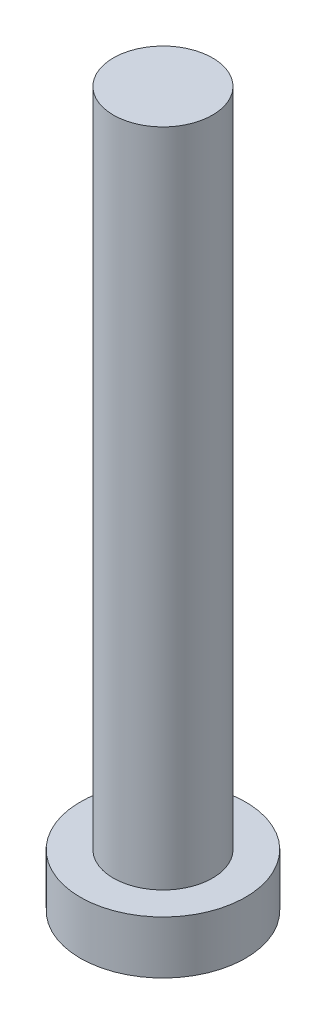
ISO-10303-21;
HEADER;
FILE_DESCRIPTION(('STEP AP214'),'2;1');
FILE_NAME('part.step','',(''),(''),'','','');
FILE_SCHEMA(('AUTOMOTIVE_DESIGN { 1 0 10303 214 1 1 1 1 }'));
ENDSEC;
DATA;
#1=APPLICATION_CONTEXT('core data for automotive mechanical design processes');
#2=APPLICATION_PROTOCOL_DEFINITION('international standard','automotive_design',2000,#1);
#3=PRODUCT_CONTEXT('',#1,'mechanical');
#4=PRODUCT('Part','Part','',(#3));
#5=PRODUCT_RELATED_PRODUCT_CATEGORY('part','',(#4));
#6=PRODUCT_DEFINITION_FORMATION('','',#4);
#7=PRODUCT_DEFINITION_CONTEXT('part definition',#1,'design');
#8=PRODUCT_DEFINITION('design','',#6,#7);
#9=PRODUCT_DEFINITION_SHAPE('','',#8);
#10=(LENGTH_UNIT() NAMED_UNIT(*) SI_UNIT(.MILLI.,.METRE.));
#11=(NAMED_UNIT(*) PLANE_ANGLE_UNIT() SI_UNIT($,.RADIAN.));
#12=(NAMED_UNIT(*) SI_UNIT($,.STERADIAN.) SOLID_ANGLE_UNIT());
#13=UNCERTAINTY_MEASURE_WITH_UNIT(LENGTH_MEASURE(1.E-05),#10,'distance_accuracy_value','');
#14=(GEOMETRIC_REPRESENTATION_CONTEXT(3) GLOBAL_UNCERTAINTY_ASSIGNED_CONTEXT((#13)) GLOBAL_UNIT_ASSIGNED_CONTEXT((#10,
#11,#12)) REPRESENTATION_CONTEXT('',''));
#15=CARTESIAN_POINT('',(0.,0.,0.));
#16=DIRECTION('',(0.,0.,1.));
#17=DIRECTION('',(1.,0.,0.));
#18=AXIS2_PLACEMENT_3D('',#15,#16,#17);
#19=CARTESIAN_POINT('',(0.,0.,0.));
#20=DIRECTION('',(0.,1.,0.));
#21=DIRECTION('',(0.,0.,1.));
#22=AXIS2_PLACEMENT_3D('',#19,#20,#21);
#23=PLANE('',#22);
#24=CARTESIAN_POINT('',(0.,0.,0.));
#25=DIRECTION('',(0.,1.,0.));
#26=DIRECTION('',(0.,0.,1.));
#27=AXIS2_PLACEMENT_3D('',#24,#25,#26);
#28=CIRCLE('',#27,2.5);
#29=CARTESIAN_POINT('',(0.,0.,2.5));
#30=VERTEX_POINT('',#29);
#31=EDGE_CURVE('E39',#30,#30,#28,.T.);
#32=ORIENTED_EDGE('',*,*,#31,.F.);
#33=EDGE_LOOP('',(#32));
#34=FACE_BOUND('',#33,.T.);
#35=CARTESIAN_POINT('',(1.,0.,1.));
#36=DIRECTION('',(0.,1.,0.));
#37=DIRECTION('',(0.,0.,-1.));
#38=AXIS2_PLACEMENT_3D('',#35,#36,#37);
#39=CIRCLE('',#38,0.5);
#40=CARTESIAN_POINT('',(1.,0.,0.5));
#41=VERTEX_POINT('',#40);
#42=CARTESIAN_POINT('',(0.5,0.,1.));
#43=VERTEX_POINT('',#42);
#44=EDGE_CURVE('E186',#41,#43,#39,.T.);
#45=ORIENTED_EDGE('',*,*,#44,.F.);
#46=DIRECTION('',(-1.,0.,0.));
#47=VECTOR('',#46,1.);
#48=CARTESIAN_POINT('',(1.,0.,0.5));
#49=LINE('',#48,#47);
#50=CARTESIAN_POINT('',(1.75,0.,0.5));
#51=VERTEX_POINT('',#50);
#52=EDGE_CURVE('E52',#51,#41,#49,.T.);
#53=ORIENTED_EDGE('',*,*,#52,.F.);
#54=DIRECTION('',(0.,0.,1.));
#55=VECTOR('',#54,1.);
#56=CARTESIAN_POINT('',(1.75,0.,-0.5));
#57=LINE('',#56,#55);
#58=CARTESIAN_POINT('',(1.75,0.,-0.5));
#59=VERTEX_POINT('',#58);
#60=EDGE_CURVE('E225',#59,#51,#57,.T.);
#61=ORIENTED_EDGE('',*,*,#60,.F.);
#62=DIRECTION('',(1.,0.,0.));
#63=VECTOR('',#62,1.);
#64=CARTESIAN_POINT('',(1.,0.,-0.5));
#65=LINE('',#64,#63);
#66=CARTESIAN_POINT('',(1.,0.,-0.5));
#67=VERTEX_POINT('',#66);
#68=EDGE_CURVE('E223',#67,#59,#65,.T.);
#69=ORIENTED_EDGE('',*,*,#68,.F.);
#70=CARTESIAN_POINT('',(1.,0.,-1.));
#71=DIRECTION('',(0.,1.,0.));
#72=DIRECTION('',(0.,0.,-1.));
#73=AXIS2_PLACEMENT_3D('',#70,#71,#72);
#74=CIRCLE('',#73,0.5);
#75=CARTESIAN_POINT('',(0.5,0.,-1.));
#76=VERTEX_POINT('',#75);
#77=EDGE_CURVE('E160',#76,#67,#74,.T.);
#78=ORIENTED_EDGE('',*,*,#77,.F.);
#79=DIRECTION('',(0.,0.,1.));
#80=VECTOR('',#79,1.);
#81=CARTESIAN_POINT('',(0.5,0.,-1.75));
#82=LINE('',#81,#80);
#83=CARTESIAN_POINT('',(0.5,0.,-1.75));
#84=VERTEX_POINT('',#83);
#85=EDGE_CURVE('E219',#84,#76,#82,.T.);
#86=ORIENTED_EDGE('',*,*,#85,.F.);
#87=DIRECTION('',(1.,0.,0.));
#88=VECTOR('',#87,1.);
#89=CARTESIAN_POINT('',(-0.5,0.,-1.75));
#90=LINE('',#89,#88);
#91=CARTESIAN_POINT('',(-0.5,0.,-1.75));
#92=VERTEX_POINT('',#91);
#93=EDGE_CURVE('E216',#92,#84,#90,.T.);
#94=ORIENTED_EDGE('',*,*,#93,.F.);
#95=DIRECTION('',(0.,0.,-1.));
#96=VECTOR('',#95,1.);
#97=CARTESIAN_POINT('',(-0.5,0.,-1.75));
#98=LINE('',#97,#96);
#99=CARTESIAN_POINT('',(-0.5,0.,-1.));
#100=VERTEX_POINT('',#99);
#101=EDGE_CURVE('E213',#100,#92,#98,.T.);
#102=ORIENTED_EDGE('',*,*,#101,.F.);
#103=CARTESIAN_POINT('',(-1.,0.,-1.));
#104=DIRECTION('',(0.,1.,0.));
#105=DIRECTION('',(0.,0.,-1.));
#106=AXIS2_PLACEMENT_3D('',#103,#104,#105);
#107=CIRCLE('',#106,0.5);
#108=CARTESIAN_POINT('',(-1.,0.,-0.5));
#109=VERTEX_POINT('',#108);
#110=EDGE_CURVE('E210',#109,#100,#107,.T.);
#111=ORIENTED_EDGE('',*,*,#110,.F.);
#112=DIRECTION('',(1.,0.,0.));
#113=VECTOR('',#112,1.);
#114=CARTESIAN_POINT('',(-1.75,0.,-0.5));
#115=LINE('',#114,#113);
#116=CARTESIAN_POINT('',(-1.75,0.,-0.5));
#117=VERTEX_POINT('',#116);
#118=EDGE_CURVE('E207',#117,#109,#115,.T.);
#119=ORIENTED_EDGE('',*,*,#118,.F.);
#120=DIRECTION('',(0.,0.,-1.));
#121=VECTOR('',#120,1.);
#122=CARTESIAN_POINT('',(-1.75,0.,-0.5));
#123=LINE('',#122,#121);
#124=CARTESIAN_POINT('',(-1.75,0.,0.5));
#125=VERTEX_POINT('',#124);
#126=EDGE_CURVE('E204',#125,#117,#123,.T.);
#127=ORIENTED_EDGE('',*,*,#126,.F.);
#128=DIRECTION('',(-1.,0.,0.));
#129=VECTOR('',#128,1.);
#130=CARTESIAN_POINT('',(-1.75,0.,0.5));
#131=LINE('',#130,#129);
#132=CARTESIAN_POINT('',(-1.,0.,0.5));
#133=VERTEX_POINT('',#132);
#134=EDGE_CURVE('E201',#133,#125,#131,.T.);
#135=ORIENTED_EDGE('',*,*,#134,.F.);
#136=CARTESIAN_POINT('',(-1.,0.,1.));
#137=DIRECTION('',(0.,1.,0.));
#138=DIRECTION('',(0.,0.,1.));
#139=AXIS2_PLACEMENT_3D('',#136,#137,#138);
#140=CIRCLE('',#139,0.5);
#141=CARTESIAN_POINT('',(-0.5,0.,1.));
#142=VERTEX_POINT('',#141);
#143=EDGE_CURVE('E198',#142,#133,#140,.T.);
#144=ORIENTED_EDGE('',*,*,#143,.F.);
#145=DIRECTION('',(0.,0.,-1.));
#146=VECTOR('',#145,1.);
#147=CARTESIAN_POINT('',(-0.5,0.,1.));
#148=LINE('',#147,#146);
#149=CARTESIAN_POINT('',(-0.5,0.,1.75));
#150=VERTEX_POINT('',#149);
#151=EDGE_CURVE('E195',#150,#142,#148,.T.);
#152=ORIENTED_EDGE('',*,*,#151,.F.);
#153=DIRECTION('',(-1.,0.,0.));
#154=VECTOR('',#153,1.);
#155=CARTESIAN_POINT('',(-0.5,0.,1.75));
#156=LINE('',#155,#154);
#157=CARTESIAN_POINT('',(0.5,0.,1.75));
#158=VERTEX_POINT('',#157);
#159=EDGE_CURVE('E192',#158,#150,#156,.T.);
#160=ORIENTED_EDGE('',*,*,#159,.F.);
#161=DIRECTION('',(0.,0.,1.));
#162=VECTOR('',#161,1.);
#163=CARTESIAN_POINT('',(0.5,0.,1.));
#164=LINE('',#163,#162);
#165=EDGE_CURVE('E189',#43,#158,#164,.T.);
#166=ORIENTED_EDGE('',*,*,#165,.F.);
#167=EDGE_LOOP('',(#45,#53,#61,#69,#78,#86,#94,#102,#111,#119,#127,#135,#144,#152,#160,#166));
#168=FACE_BOUND('',#167,.T.);
#169=ADVANCED_FACE('F35',(#34,#168),#23,.F.);
#170=CARTESIAN_POINT('',(0.,1.6,0.));
#171=DIRECTION('',(0.,-1.,0.));
#172=DIRECTION('',(0.,0.,-1.));
#173=AXIS2_PLACEMENT_3D('',#170,#171,#172);
#174=CYLINDRICAL_SURFACE('',#173,2.5);
#175=CARTESIAN_POINT('',(0.,1.6,0.));
#176=DIRECTION('',(0.,1.,0.));
#177=DIRECTION('',(0.,0.,1.));
#178=AXIS2_PLACEMENT_3D('',#175,#176,#177);
#179=CIRCLE('',#178,2.5);
#180=CARTESIAN_POINT('',(0.,1.6,2.5));
#181=VERTEX_POINT('',#180);
#182=EDGE_CURVE('E44',#181,#181,#179,.T.);
#183=ORIENTED_EDGE('',*,*,#182,.F.);
#184=EDGE_LOOP('',(#183));
#185=FACE_BOUND('',#184,.T.);
#186=ORIENTED_EDGE('',*,*,#31,.T.);
#187=EDGE_LOOP('',(#186));
#188=FACE_BOUND('',#187,.T.);
#189=ADVANCED_FACE('F37',(#185,#188),#174,.T.);
#190=CARTESIAN_POINT('',(0.,1.6,0.));
#191=DIRECTION('',(0.,1.,0.));
#192=DIRECTION('',(0.,0.,1.));
#193=AXIS2_PLACEMENT_3D('',#190,#191,#192);
#194=PLANE('',#193);
#195=CARTESIAN_POINT('',(0.,1.6,0.));
#196=DIRECTION('',(0.,1.,0.));
#197=DIRECTION('',(0.,0.,1.));
#198=AXIS2_PLACEMENT_3D('',#195,#196,#197);
#199=CIRCLE('',#198,1.5);
#200=CARTESIAN_POINT('',(0.,1.6,1.5));
#201=VERTEX_POINT('',#200);
#202=EDGE_CURVE('E11',#201,#201,#199,.T.);
#203=ORIENTED_EDGE('',*,*,#202,.F.);
#204=EDGE_LOOP('',(#203));
#205=FACE_BOUND('',#204,.T.);
#206=ORIENTED_EDGE('',*,*,#182,.T.);
#207=EDGE_LOOP('',(#206));
#208=FACE_BOUND('',#207,.T.);
#209=ADVANCED_FACE('F374',(#205,#208),#194,.T.);
#210=CARTESIAN_POINT('',(0.,21.6,0.));
#211=DIRECTION('',(0.,-1.,0.));
#212=DIRECTION('',(0.,0.,-1.));
#213=AXIS2_PLACEMENT_3D('',#210,#211,#212);
#214=CYLINDRICAL_SURFACE('',#213,1.5);
#215=CARTESIAN_POINT('',(0.,21.6,0.));
#216=DIRECTION('',(0.,1.,0.));
#217=DIRECTION('',(0.,0.,1.));
#218=AXIS2_PLACEMENT_3D('',#215,#216,#217);
#219=CIRCLE('',#218,1.5);
#220=CARTESIAN_POINT('',(0.,21.6,1.5));
#221=VERTEX_POINT('',#220);
#222=EDGE_CURVE('E229',#221,#221,#219,.T.);
#223=ORIENTED_EDGE('',*,*,#222,.F.);
#224=EDGE_LOOP('',(#223));
#225=FACE_BOUND('',#224,.T.);
#226=ORIENTED_EDGE('',*,*,#202,.T.);
#227=EDGE_LOOP('',(#226));
#228=FACE_BOUND('',#227,.T.);
#229=ADVANCED_FACE('F370',(#225,#228),#214,.T.);
#230=CARTESIAN_POINT('',(0.,21.6,0.));
#231=DIRECTION('',(0.,1.,0.));
#232=DIRECTION('',(0.,0.,1.));
#233=AXIS2_PLACEMENT_3D('',#230,#231,#232);
#234=PLANE('',#233);
#235=ORIENTED_EDGE('',*,*,#222,.T.);
#236=EDGE_LOOP('',(#235));
#237=FACE_BOUND('',#236,.T.);
#238=ADVANCED_FACE('F320',(#237),#234,.T.);
#239=CARTESIAN_POINT('',(1.,1.,0.5));
#240=DIRECTION('',(0.,0.,1.));
#241=DIRECTION('',(1.,0.,0.));
#242=AXIS2_PLACEMENT_3D('',#239,#240,#241);
#243=PLANE('',#242);
#244=ORIENTED_EDGE('',*,*,#52,.T.);
#245=DIRECTION('',(0.,-1.,0.));
#246=VECTOR('',#245,1.);
#247=CARTESIAN_POINT('',(1.,1.,0.5));
#248=LINE('',#247,#246);
#249=CARTESIAN_POINT('',(1.,1.,0.5));
#250=VERTEX_POINT('',#249);
#251=EDGE_CURVE('E112',#250,#41,#248,.T.);
#252=ORIENTED_EDGE('',*,*,#251,.F.);
#253=DIRECTION('',(-1.,0.,0.));
#254=VECTOR('',#253,1.);
#255=CARTESIAN_POINT('',(1.,1.,0.5));
#256=LINE('',#255,#254);
#257=CARTESIAN_POINT('',(1.75,1.,0.5));
#258=VERTEX_POINT('',#257);
#259=EDGE_CURVE('E227',#258,#250,#256,.T.);
#260=ORIENTED_EDGE('',*,*,#259,.F.);
#261=DIRECTION('',(0.,-1.,0.));
#262=VECTOR('',#261,1.);
#263=CARTESIAN_POINT('',(1.75,1.,0.5));
#264=LINE('',#263,#262);
#265=EDGE_CURVE('E60',#258,#51,#264,.T.);
#266=ORIENTED_EDGE('',*,*,#265,.T.);
#267=EDGE_LOOP('',(#244,#252,#260,#266));
#268=FACE_BOUND('',#267,.T.);
#269=ADVANCED_FACE('F313',(#268),#243,.F.);
#270=CARTESIAN_POINT('',(1.75,1.,-0.5));
#271=DIRECTION('',(1.,0.,0.));
#272=DIRECTION('',(0.,0.,-1.));
#273=AXIS2_PLACEMENT_3D('',#270,#271,#272);
#274=PLANE('',#273);
#275=ORIENTED_EDGE('',*,*,#60,.T.);
#276=ORIENTED_EDGE('',*,*,#265,.F.);
#277=DIRECTION('',(0.,0.,1.));
#278=VECTOR('',#277,1.);
#279=CARTESIAN_POINT('',(1.75,1.,-0.5));
#280=LINE('',#279,#278);
#281=CARTESIAN_POINT('',(1.75,1.,-0.5));
#282=VERTEX_POINT('',#281);
#283=EDGE_CURVE('E172',#282,#258,#280,.T.);
#284=ORIENTED_EDGE('',*,*,#283,.F.);
#285=DIRECTION('',(0.,-1.,0.));
#286=VECTOR('',#285,1.);
#287=CARTESIAN_POINT('',(1.75,1.,-0.5));
#288=LINE('',#287,#286);
#289=EDGE_CURVE('E164',#282,#59,#288,.T.);
#290=ORIENTED_EDGE('',*,*,#289,.T.);
#291=EDGE_LOOP('',(#275,#276,#284,#290));
#292=FACE_BOUND('',#291,.T.);
#293=ADVANCED_FACE('F311',(#292),#274,.F.);
#294=CARTESIAN_POINT('',(1.,1.,-0.5));
#295=DIRECTION('',(0.,0.,-1.));
#296=DIRECTION('',(-1.,0.,0.));
#297=AXIS2_PLACEMENT_3D('',#294,#295,#296);
#298=PLANE('',#297);
#299=ORIENTED_EDGE('',*,*,#68,.T.);
#300=ORIENTED_EDGE('',*,*,#289,.F.);
#301=DIRECTION('',(1.,0.,0.));
#302=VECTOR('',#301,1.);
#303=CARTESIAN_POINT('',(1.,1.,-0.5));
#304=LINE('',#303,#302);
#305=CARTESIAN_POINT('',(1.,1.,-0.5));
#306=VERTEX_POINT('',#305);
#307=EDGE_CURVE('E168',#306,#282,#304,.T.);
#308=ORIENTED_EDGE('',*,*,#307,.F.);
#309=DIRECTION('',(0.,-1.,0.));
#310=VECTOR('',#309,1.);
#311=CARTESIAN_POINT('',(1.,1.,-0.5));
#312=LINE('',#311,#310);
#313=EDGE_CURVE('E153',#306,#67,#312,.T.);
#314=ORIENTED_EDGE('',*,*,#313,.T.);
#315=EDGE_LOOP('',(#299,#300,#308,#314));
#316=FACE_BOUND('',#315,.T.);
#317=ADVANCED_FACE('F169',(#316),#298,.F.);
#318=CARTESIAN_POINT('',(1.,1.,-1.));
#319=DIRECTION('',(0.,-1.,0.));
#320=DIRECTION('',(0.,0.,-1.));
#321=AXIS2_PLACEMENT_3D('',#318,#319,#320);
#322=CYLINDRICAL_SURFACE('',#321,0.5);
#323=ORIENTED_EDGE('',*,*,#77,.T.);
#324=ORIENTED_EDGE('',*,*,#313,.F.);
#325=CARTESIAN_POINT('',(1.,1.,-1.));
#326=DIRECTION('',(0.,1.,0.));
#327=DIRECTION('',(0.,0.,-1.));
#328=AXIS2_PLACEMENT_3D('',#325,#326,#327);
#329=CIRCLE('',#328,0.5);
#330=CARTESIAN_POINT('',(0.5,1.,-1.));
#331=VERTEX_POINT('',#330);
#332=EDGE_CURVE('E157',#331,#306,#329,.T.);
#333=ORIENTED_EDGE('',*,*,#332,.F.);
#334=DIRECTION('',(0.,-1.,0.));
#335=VECTOR('',#334,1.);
#336=CARTESIAN_POINT('',(0.5,1.,-1.));
#337=LINE('',#336,#335);
#338=EDGE_CURVE('E165',#331,#76,#337,.T.);
#339=ORIENTED_EDGE('',*,*,#338,.T.);
#340=EDGE_LOOP('',(#323,#324,#333,#339));
#341=FACE_BOUND('',#340,.T.);
#342=ADVANCED_FACE('F155',(#341),#322,.T.);
#343=CARTESIAN_POINT('',(0.5,1.,-1.75));
#344=DIRECTION('',(1.,0.,0.));
#345=DIRECTION('',(0.,0.,-1.));
#346=AXIS2_PLACEMENT_3D('',#343,#344,#345);
#347=PLANE('',#346);
#348=ORIENTED_EDGE('',*,*,#85,.T.);
#349=ORIENTED_EDGE('',*,*,#338,.F.);
#350=DIRECTION('',(0.,0.,1.));
#351=VECTOR('',#350,1.);
#352=CARTESIAN_POINT('',(0.5,1.,-1.75));
#353=LINE('',#352,#351);
#354=CARTESIAN_POINT('',(0.5,1.,-1.75));
#355=VERTEX_POINT('',#354);
#356=EDGE_CURVE('E178',#355,#331,#353,.T.);
#357=ORIENTED_EDGE('',*,*,#356,.F.);
#358=DIRECTION('',(0.,-1.,0.));
#359=VECTOR('',#358,1.);
#360=CARTESIAN_POINT('',(0.5,1.,-1.75));
#361=LINE('',#360,#359);
#362=EDGE_CURVE('E232',#355,#84,#361,.T.);
#363=ORIENTED_EDGE('',*,*,#362,.T.);
#364=EDGE_LOOP('',(#348,#349,#357,#363));
#365=FACE_BOUND('',#364,.T.);
#366=ADVANCED_FACE('F310',(#365),#347,.F.);
#367=CARTESIAN_POINT('',(-0.5,1.,-1.75));
#368=DIRECTION('',(0.,0.,-1.));
#369=DIRECTION('',(-1.,0.,0.));
#370=AXIS2_PLACEMENT_3D('',#367,#368,#369);
#371=PLANE('',#370);
#372=ORIENTED_EDGE('',*,*,#93,.T.);
#373=ORIENTED_EDGE('',*,*,#362,.F.);
#374=DIRECTION('',(1.,0.,0.));
#375=VECTOR('',#374,1.);
#376=CARTESIAN_POINT('',(-0.5,1.,-1.75));
#377=LINE('',#376,#375);
#378=CARTESIAN_POINT('',(-0.5,1.,-1.75));
#379=VERTEX_POINT('',#378);
#380=EDGE_CURVE('E180',#379,#355,#377,.T.);
#381=ORIENTED_EDGE('',*,*,#380,.F.);
#382=DIRECTION('',(0.,-1.,0.));
#383=VECTOR('',#382,1.);
#384=CARTESIAN_POINT('',(-0.5,1.,-1.75));
#385=LINE('',#384,#383);
#386=EDGE_CURVE('E234',#379,#92,#385,.T.);
#387=ORIENTED_EDGE('',*,*,#386,.T.);
#388=EDGE_LOOP('',(#372,#373,#381,#387));
#389=FACE_BOUND('',#388,.T.);
#390=ADVANCED_FACE('F306',(#389),#371,.F.);
#391=CARTESIAN_POINT('',(-0.5,1.,-1.75));
#392=DIRECTION('',(-1.,0.,0.));
#393=DIRECTION('',(0.,0.,1.));
#394=AXIS2_PLACEMENT_3D('',#391,#392,#393);
#395=PLANE('',#394);
#396=ORIENTED_EDGE('',*,*,#101,.T.);
#397=ORIENTED_EDGE('',*,*,#386,.F.);
#398=DIRECTION('',(0.,0.,-1.));
#399=VECTOR('',#398,1.);
#400=CARTESIAN_POINT('',(-0.5,1.,-1.75));
#401=LINE('',#400,#399);
#402=CARTESIAN_POINT('',(-0.5,1.,-1.));
#403=VERTEX_POINT('',#402);
#404=EDGE_CURVE('E301',#403,#379,#401,.T.);
#405=ORIENTED_EDGE('',*,*,#404,.F.);
#406=DIRECTION('',(0.,-1.,0.));
#407=VECTOR('',#406,1.);
#408=CARTESIAN_POINT('',(-0.5,1.,-1.));
#409=LINE('',#408,#407);
#410=EDGE_CURVE('E236',#403,#100,#409,.T.);
#411=ORIENTED_EDGE('',*,*,#410,.T.);
#412=EDGE_LOOP('',(#396,#397,#405,#411));
#413=FACE_BOUND('',#412,.T.);
#414=ADVANCED_FACE('F330',(#413),#395,.F.);
#415=CARTESIAN_POINT('',(-1.,1.,-1.));
#416=DIRECTION('',(0.,-1.,0.));
#417=DIRECTION('',(0.,0.,-1.));
#418=AXIS2_PLACEMENT_3D('',#415,#416,#417);
#419=CYLINDRICAL_SURFACE('',#418,0.5);
#420=ORIENTED_EDGE('',*,*,#110,.T.);
#421=ORIENTED_EDGE('',*,*,#410,.F.);
#422=CARTESIAN_POINT('',(-1.,1.,-1.));
#423=DIRECTION('',(0.,1.,0.));
#424=DIRECTION('',(0.,0.,-1.));
#425=AXIS2_PLACEMENT_3D('',#422,#423,#424);
#426=CIRCLE('',#425,0.5);
#427=CARTESIAN_POINT('',(-1.,1.,-0.5));
#428=VERTEX_POINT('',#427);
#429=EDGE_CURVE('E298',#428,#403,#426,.T.);
#430=ORIENTED_EDGE('',*,*,#429,.F.);
#431=DIRECTION('',(0.,-1.,0.));
#432=VECTOR('',#431,1.);
#433=CARTESIAN_POINT('',(-1.,1.,-0.5));
#434=LINE('',#433,#432);
#435=EDGE_CURVE('E238',#428,#109,#434,.T.);
#436=ORIENTED_EDGE('',*,*,#435,.T.);
#437=EDGE_LOOP('',(#420,#421,#430,#436));
#438=FACE_BOUND('',#437,.T.);
#439=ADVANCED_FACE('F333',(#438),#419,.T.);
#440=CARTESIAN_POINT('',(-1.75,1.,-0.5));
#441=DIRECTION('',(0.,0.,-1.));
#442=DIRECTION('',(-1.,0.,0.));
#443=AXIS2_PLACEMENT_3D('',#440,#441,#442);
#444=PLANE('',#443);
#445=ORIENTED_EDGE('',*,*,#118,.T.);
#446=ORIENTED_EDGE('',*,*,#435,.F.);
#447=DIRECTION('',(1.,0.,0.));
#448=VECTOR('',#447,1.);
#449=CARTESIAN_POINT('',(-1.75,1.,-0.5));
#450=LINE('',#449,#448);
#451=CARTESIAN_POINT('',(-1.75,1.,-0.5));
#452=VERTEX_POINT('',#451);
#453=EDGE_CURVE('E295',#452,#428,#450,.T.);
#454=ORIENTED_EDGE('',*,*,#453,.F.);
#455=DIRECTION('',(0.,-1.,0.));
#456=VECTOR('',#455,1.);
#457=CARTESIAN_POINT('',(-1.75,1.,-0.5));
#458=LINE('',#457,#456);
#459=EDGE_CURVE('E240',#452,#117,#458,.T.);
#460=ORIENTED_EDGE('',*,*,#459,.T.);
#461=EDGE_LOOP('',(#445,#446,#454,#460));
#462=FACE_BOUND('',#461,.T.);
#463=ADVANCED_FACE('F337',(#462),#444,.F.);
#464=CARTESIAN_POINT('',(-1.75,1.,-0.5));
#465=DIRECTION('',(-1.,0.,0.));
#466=DIRECTION('',(0.,0.,1.));
#467=AXIS2_PLACEMENT_3D('',#464,#465,#466);
#468=PLANE('',#467);
#469=ORIENTED_EDGE('',*,*,#126,.T.);
#470=ORIENTED_EDGE('',*,*,#459,.F.);
#471=DIRECTION('',(0.,0.,-1.));
#472=VECTOR('',#471,1.);
#473=CARTESIAN_POINT('',(-1.75,1.,-0.5));
#474=LINE('',#473,#472);
#475=CARTESIAN_POINT('',(-1.75,1.,0.5));
#476=VERTEX_POINT('',#475);
#477=EDGE_CURVE('E292',#476,#452,#474,.T.);
#478=ORIENTED_EDGE('',*,*,#477,.F.);
#479=DIRECTION('',(0.,-1.,0.));
#480=VECTOR('',#479,1.);
#481=CARTESIAN_POINT('',(-1.75,1.,0.5));
#482=LINE('',#481,#480);
#483=EDGE_CURVE('E242',#476,#125,#482,.T.);
#484=ORIENTED_EDGE('',*,*,#483,.T.);
#485=EDGE_LOOP('',(#469,#470,#478,#484));
#486=FACE_BOUND('',#485,.T.);
#487=ADVANCED_FACE('F341',(#486),#468,.F.);
#488=CARTESIAN_POINT('',(-1.75,1.,0.5));
#489=DIRECTION('',(0.,0.,1.));
#490=DIRECTION('',(1.,0.,0.));
#491=AXIS2_PLACEMENT_3D('',#488,#489,#490);
#492=PLANE('',#491);
#493=ORIENTED_EDGE('',*,*,#134,.T.);
#494=ORIENTED_EDGE('',*,*,#483,.F.);
#495=DIRECTION('',(-1.,0.,0.));
#496=VECTOR('',#495,1.);
#497=CARTESIAN_POINT('',(-1.75,1.,0.5));
#498=LINE('',#497,#496);
#499=CARTESIAN_POINT('',(-1.,1.,0.5));
#500=VERTEX_POINT('',#499);
#501=EDGE_CURVE('E289',#500,#476,#498,.T.);
#502=ORIENTED_EDGE('',*,*,#501,.F.);
#503=DIRECTION('',(0.,-1.,0.));
#504=VECTOR('',#503,1.);
#505=CARTESIAN_POINT('',(-1.,1.,0.5));
#506=LINE('',#505,#504);
#507=EDGE_CURVE('E244',#500,#133,#506,.T.);
#508=ORIENTED_EDGE('',*,*,#507,.T.);
#509=EDGE_LOOP('',(#493,#494,#502,#508));
#510=FACE_BOUND('',#509,.T.);
#511=ADVANCED_FACE('F345',(#510),#492,.F.);
#512=CARTESIAN_POINT('',(-1.,1.,1.));
#513=DIRECTION('',(0.,-1.,0.));
#514=DIRECTION('',(0.,0.,-1.));
#515=AXIS2_PLACEMENT_3D('',#512,#513,#514);
#516=CYLINDRICAL_SURFACE('',#515,0.5);
#517=ORIENTED_EDGE('',*,*,#143,.T.);
#518=ORIENTED_EDGE('',*,*,#507,.F.);
#519=CARTESIAN_POINT('',(-1.,1.,1.));
#520=DIRECTION('',(0.,1.,0.));
#521=DIRECTION('',(0.,0.,1.));
#522=AXIS2_PLACEMENT_3D('',#519,#520,#521);
#523=CIRCLE('',#522,0.5);
#524=CARTESIAN_POINT('',(-0.5,1.,1.));
#525=VERTEX_POINT('',#524);
#526=EDGE_CURVE('E286',#525,#500,#523,.T.);
#527=ORIENTED_EDGE('',*,*,#526,.F.);
#528=DIRECTION('',(0.,-1.,0.));
#529=VECTOR('',#528,1.);
#530=CARTESIAN_POINT('',(-0.5,1.,1.));
#531=LINE('',#530,#529);
#532=EDGE_CURVE('E246',#525,#142,#531,.T.);
#533=ORIENTED_EDGE('',*,*,#532,.T.);
#534=EDGE_LOOP('',(#517,#518,#527,#533));
#535=FACE_BOUND('',#534,.T.);
#536=ADVANCED_FACE('F349',(#535),#516,.T.);
#537=CARTESIAN_POINT('',(-0.5,1.,1.));
#538=DIRECTION('',(-1.,0.,0.));
#539=DIRECTION('',(0.,0.,1.));
#540=AXIS2_PLACEMENT_3D('',#537,#538,#539);
#541=PLANE('',#540);
#542=ORIENTED_EDGE('',*,*,#151,.T.);
#543=ORIENTED_EDGE('',*,*,#532,.F.);
#544=DIRECTION('',(0.,0.,-1.));
#545=VECTOR('',#544,1.);
#546=CARTESIAN_POINT('',(-0.5,1.,1.));
#547=LINE('',#546,#545);
#548=CARTESIAN_POINT('',(-0.5,1.,1.75));
#549=VERTEX_POINT('',#548);
#550=EDGE_CURVE('E283',#549,#525,#547,.T.);
#551=ORIENTED_EDGE('',*,*,#550,.F.);
#552=DIRECTION('',(0.,-1.,0.));
#553=VECTOR('',#552,1.);
#554=CARTESIAN_POINT('',(-0.5,1.,1.75));
#555=LINE('',#554,#553);
#556=EDGE_CURVE('E248',#549,#150,#555,.T.);
#557=ORIENTED_EDGE('',*,*,#556,.T.);
#558=EDGE_LOOP('',(#542,#543,#551,#557));
#559=FACE_BOUND('',#558,.T.);
#560=ADVANCED_FACE('F353',(#559),#541,.F.);
#561=CARTESIAN_POINT('',(-0.5,1.,1.75));
#562=DIRECTION('',(0.,0.,1.));
#563=DIRECTION('',(1.,0.,0.));
#564=AXIS2_PLACEMENT_3D('',#561,#562,#563);
#565=PLANE('',#564);
#566=ORIENTED_EDGE('',*,*,#159,.T.);
#567=ORIENTED_EDGE('',*,*,#556,.F.);
#568=DIRECTION('',(-1.,0.,0.));
#569=VECTOR('',#568,1.);
#570=CARTESIAN_POINT('',(-0.5,1.,1.75));
#571=LINE('',#570,#569);
#572=CARTESIAN_POINT('',(0.5,1.,1.75));
#573=VERTEX_POINT('',#572);
#574=EDGE_CURVE('E280',#573,#549,#571,.T.);
#575=ORIENTED_EDGE('',*,*,#574,.F.);
#576=DIRECTION('',(0.,-1.,0.));
#577=VECTOR('',#576,1.);
#578=CARTESIAN_POINT('',(0.5,1.,1.75));
#579=LINE('',#578,#577);
#580=EDGE_CURVE('E250',#573,#158,#579,.T.);
#581=ORIENTED_EDGE('',*,*,#580,.T.);
#582=EDGE_LOOP('',(#566,#567,#575,#581));
#583=FACE_BOUND('',#582,.T.);
#584=ADVANCED_FACE('F357',(#583),#565,.F.);
#585=CARTESIAN_POINT('',(0.5,1.,1.));
#586=DIRECTION('',(1.,0.,0.));
#587=DIRECTION('',(0.,0.,-1.));
#588=AXIS2_PLACEMENT_3D('',#585,#586,#587);
#589=PLANE('',#588);
#590=ORIENTED_EDGE('',*,*,#165,.T.);
#591=ORIENTED_EDGE('',*,*,#580,.F.);
#592=DIRECTION('',(0.,0.,1.));
#593=VECTOR('',#592,1.);
#594=CARTESIAN_POINT('',(0.5,1.,1.));
#595=LINE('',#594,#593);
#596=CARTESIAN_POINT('',(0.5,1.,1.));
#597=VERTEX_POINT('',#596);
#598=EDGE_CURVE('E275',#597,#573,#595,.T.);
#599=ORIENTED_EDGE('',*,*,#598,.F.);
#600=DIRECTION('',(0.,-1.,0.));
#601=VECTOR('',#600,1.);
#602=CARTESIAN_POINT('',(0.5,1.,1.));
#603=LINE('',#602,#601);
#604=EDGE_CURVE('E252',#597,#43,#603,.T.);
#605=ORIENTED_EDGE('',*,*,#604,.T.);
#606=EDGE_LOOP('',(#590,#591,#599,#605));
#607=FACE_BOUND('',#606,.T.);
#608=ADVANCED_FACE('F361',(#607),#589,.F.);
#609=CARTESIAN_POINT('',(1.,1.,1.));
#610=DIRECTION('',(0.,-1.,0.));
#611=DIRECTION('',(0.,0.,-1.));
#612=AXIS2_PLACEMENT_3D('',#609,#610,#611);
#613=CYLINDRICAL_SURFACE('',#612,0.5);
#614=ORIENTED_EDGE('',*,*,#44,.T.);
#615=ORIENTED_EDGE('',*,*,#604,.F.);
#616=CARTESIAN_POINT('',(1.,1.,1.));
#617=DIRECTION('',(0.,1.,0.));
#618=DIRECTION('',(0.,0.,-1.));
#619=AXIS2_PLACEMENT_3D('',#616,#617,#618);
#620=CIRCLE('',#619,0.5);
#621=EDGE_CURVE('E273',#250,#597,#620,.T.);
#622=ORIENTED_EDGE('',*,*,#621,.F.);
#623=ORIENTED_EDGE('',*,*,#251,.T.);
#624=EDGE_LOOP('',(#614,#615,#622,#623));
#625=FACE_BOUND('',#624,.T.);
#626=ADVANCED_FACE('F270',(#625),#613,.T.);
#627=CARTESIAN_POINT('',(1.,1.,-1.));
#628=DIRECTION('',(0.,-1.,0.));
#629=DIRECTION('',(0.,0.,-1.));
#630=AXIS2_PLACEMENT_3D('',#627,#628,#629);
#631=PLANE('',#630);
#632=ORIENTED_EDGE('',*,*,#259,.T.);
#633=ORIENTED_EDGE('',*,*,#621,.T.);
#634=ORIENTED_EDGE('',*,*,#598,.T.);
#635=ORIENTED_EDGE('',*,*,#574,.T.);
#636=ORIENTED_EDGE('',*,*,#550,.T.);
#637=ORIENTED_EDGE('',*,*,#526,.T.);
#638=ORIENTED_EDGE('',*,*,#501,.T.);
#639=ORIENTED_EDGE('',*,*,#477,.T.);
#640=ORIENTED_EDGE('',*,*,#453,.T.);
#641=ORIENTED_EDGE('',*,*,#429,.T.);
#642=ORIENTED_EDGE('',*,*,#404,.T.);
#643=ORIENTED_EDGE('',*,*,#380,.T.);
#644=ORIENTED_EDGE('',*,*,#356,.T.);
#645=ORIENTED_EDGE('',*,*,#332,.T.);
#646=ORIENTED_EDGE('',*,*,#307,.T.);
#647=ORIENTED_EDGE('',*,*,#283,.T.);
#648=EDGE_LOOP('',(#632,#633,#634,#635,#636,#637,#638,#639,#640,#641,#642,#643,#644,#645,#646,#647));
#649=FACE_BOUND('',#648,.T.);
#650=ADVANCED_FACE('F175',(#649),#631,.T.);
#651=CLOSED_SHELL('',(#169,#189,#209,#229,#238,#269,#293,#317,#342,#366,#390,#414,#439,#463,
#487,#511,#536,#560,#584,#608,#626,#650));
#652=MANIFOLD_SOLID_BREP('B2',#651);
#653=ADVANCED_BREP_SHAPE_REPRESENTATION('',(#18,#652),#14);
#654=SHAPE_DEFINITION_REPRESENTATION(#9,#653);
ENDSEC;
END-ISO-10303-21;
